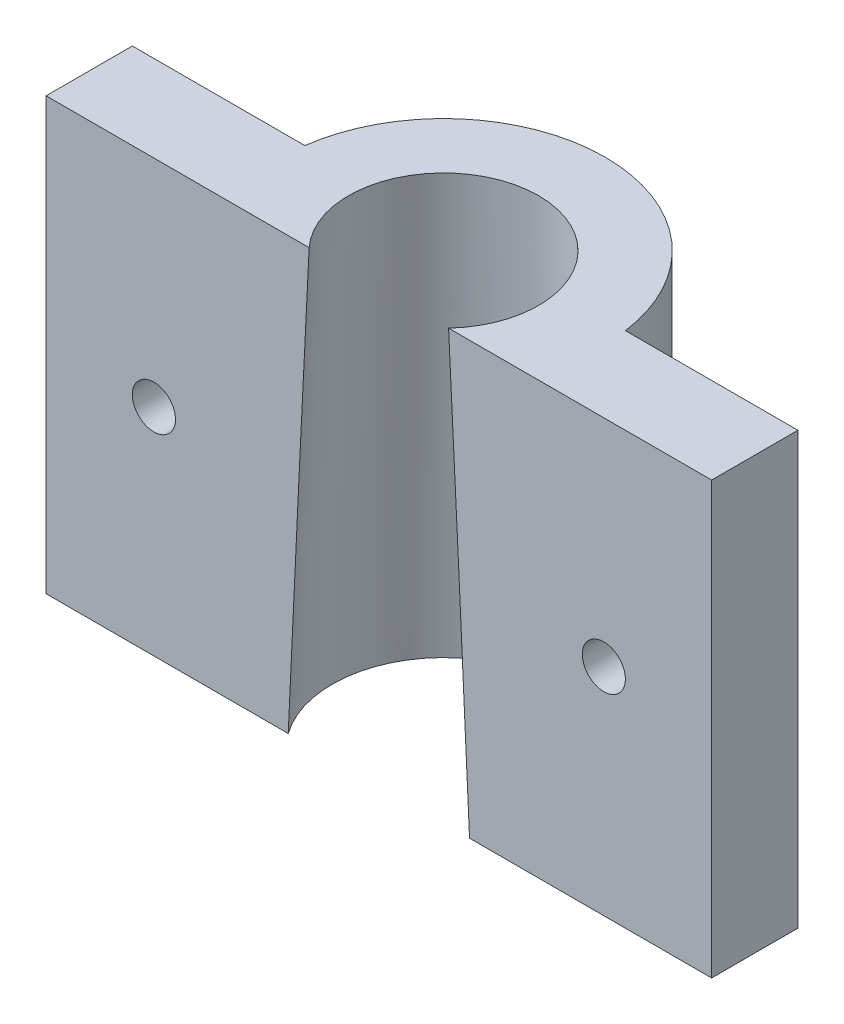
ISO-10303-21;
HEADER;
FILE_DESCRIPTION(('STEP AP214'),'2;1');
FILE_NAME('part.step','',(''),(''),'','','');
FILE_SCHEMA(('AUTOMOTIVE_DESIGN { 1 0 10303 214 1 1 1 1 }'));
ENDSEC;
DATA;
#1=APPLICATION_CONTEXT('core data for automotive mechanical design processes');
#2=APPLICATION_PROTOCOL_DEFINITION('international standard','automotive_design',2000,#1);
#3=PRODUCT_CONTEXT('',#1,'mechanical');
#4=PRODUCT('Part','Part','',(#3));
#5=PRODUCT_RELATED_PRODUCT_CATEGORY('part','',(#4));
#6=PRODUCT_DEFINITION_FORMATION('','',#4);
#7=PRODUCT_DEFINITION_CONTEXT('part definition',#1,'design');
#8=PRODUCT_DEFINITION('design','',#6,#7);
#9=PRODUCT_DEFINITION_SHAPE('','',#8);
#10=(LENGTH_UNIT() NAMED_UNIT(*) SI_UNIT(.MILLI.,.METRE.));
#11=(NAMED_UNIT(*) PLANE_ANGLE_UNIT() SI_UNIT($,.RADIAN.));
#12=(NAMED_UNIT(*) SI_UNIT($,.STERADIAN.) SOLID_ANGLE_UNIT());
#13=UNCERTAINTY_MEASURE_WITH_UNIT(LENGTH_MEASURE(1.E-05),#10,'distance_accuracy_value','');
#14=(GEOMETRIC_REPRESENTATION_CONTEXT(3) GLOBAL_UNCERTAINTY_ASSIGNED_CONTEXT((#13)) GLOBAL_UNIT_ASSIGNED_CONTEXT((#10,
#11,#12)) REPRESENTATION_CONTEXT('',''));
#15=CARTESIAN_POINT('',(0.,0.,0.));
#16=DIRECTION('',(0.,0.,1.));
#17=DIRECTION('',(1.,0.,0.));
#18=AXIS2_PLACEMENT_3D('',#15,#16,#17);
#19=CARTESIAN_POINT('',(15.4330343736593,60.,3.));
#20=DIRECTION('',(0.,0.,-1.));
#21=DIRECTION('',(-1.,0.,0.));
#22=AXIS2_PLACEMENT_3D('',#19,#20,#21);
#23=PLANE('',#22);
#24=CARTESIAN_POINT('',(-10.4330343736593,42.5,3.));
#25=DIRECTION('',(0.,0.,-1.));
#26=DIRECTION('',(1.,0.,0.));
#27=AXIS2_PLACEMENT_3D('',#24,#25,#26);
#28=CIRCLE('',#27,1.);
#29=CARTESIAN_POINT('',(-9.43303437365926,42.5,3.));
#30=VERTEX_POINT('',#29);
#31=EDGE_CURVE('E172',#30,#30,#28,.T.);
#32=ORIENTED_EDGE('',*,*,#31,.T.);
#33=EDGE_LOOP('',(#32));
#34=FACE_BOUND('',#33,.T.);
#35=DIRECTION('',(0.,-1.,0.));
#36=VECTOR('',#35,1.);
#37=CARTESIAN_POINT('',(-15.4330343736593,60.,3.));
#38=LINE('',#37,#36);
#39=CARTESIAN_POINT('',(-15.4330343736593,52.5,3.));
#40=VERTEX_POINT('',#39);
#41=CARTESIAN_POINT('',(-15.4330343736593,32.5,3.));
#42=VERTEX_POINT('',#41);
#43=EDGE_CURVE('E117',#40,#42,#38,.T.);
#44=ORIENTED_EDGE('',*,*,#43,.T.);
#45=DIRECTION('',(-1.,0.,0.));
#46=VECTOR('',#45,1.);
#47=CARTESIAN_POINT('',(-15.4330343736593,32.5,3.));
#48=LINE('',#47,#46);
#49=CARTESIAN_POINT('',(-4.20454510466969,32.5,3.));
#50=VERTEX_POINT('',#49);
#51=EDGE_CURVE('E112',#50,#42,#48,.T.);
#52=ORIENTED_EDGE('',*,*,#51,.F.);
#53=CARTESIAN_POINT('',(-6.7970653211989,-27.5114345369121,3.));
#54=CARTESIAN_POINT('',(-6.69871078157354,-25.1270260324181,3.));
#55=CARTESIAN_POINT('',(-6.60001414133945,-22.7426316265745,3.));
#56=CARTESIAN_POINT('',(-6.4018142630898,-17.9736201917859,3.));
#57=CARTESIAN_POINT('',(-6.30231093970674,-15.5890031663893,3.));
#58=CARTESIAN_POINT('',(-6.00242132289861,-8.43478617019309,3.));
#59=CARTESIAN_POINT('',(-5.80067278771601,-3.66524319009029,3.));
#60=CARTESIAN_POINT('',(-5.39226896292382,5.87364712770417,3.));
#61=CARTESIAN_POINT('',(-5.18561365934576,10.6429944648001,3.));
#62=CARTESIAN_POINT('',(-4.87040265578391,17.7961317859876,3.));
#63=CARTESIAN_POINT('',(-4.76447582691481,20.1800375802265,3.));
#64=CARTESIAN_POINT('',(-4.55047172775504,24.9477525655322,3.));
#65=CARTESIAN_POINT('',(-4.44239445767504,27.3315617566083,3.));
#66=CARTESIAN_POINT('',(-4.22357818461527,32.0990328666859,3.));
#67=CARTESIAN_POINT('',(-4.11283920983981,34.4826947869798,3.));
#68=CARTESIAN_POINT('',(-3.88798370902494,39.2498590182918,3.));
#69=CARTESIAN_POINT('',(-3.77386718407985,41.6333613293614,3.));
#70=CARTESIAN_POINT('',(-3.54125323053933,46.399486491184,3.));
#71=CARTESIAN_POINT('',(-3.42275703232255,48.7821094018508,3.));
#72=CARTESIAN_POINT('',(-3.17980660409161,53.5471242646965,3.));
#73=CARTESIAN_POINT('',(-3.05535219902303,55.9295162080264,3.));
#74=CARTESIAN_POINT('',(-2.86218400514298,59.5038278555008,3.));
#75=CARTESIAN_POINT('',(-2.79668264417257,60.6959210423072,3.));
#76=CARTESIAN_POINT('',(-2.66301438622913,63.0799576813448,3.));
#77=CARTESIAN_POINT('',(-2.59484749087833,64.2719011336665,3.));
#78=CARTESIAN_POINT('',(-2.45516754436946,66.6554887715938,3.));
#79=CARTESIAN_POINT('',(-2.38365478497229,67.8471329742172,3.));
#80=CARTESIAN_POINT('',(-2.23625823760196,70.2301470883893,3.));
#81=CARTESIAN_POINT('',(-2.16037446735979,71.421517001031,3.));
#82=CARTESIAN_POINT('',(-2.00263075228217,73.8047827566932,3.));
#83=CARTESIAN_POINT('',(-1.92076627560683,74.9966783038397,3.));
#84=CARTESIAN_POINT('',(-1.79145704162888,76.7841981543115,3.));
#85=CARTESIAN_POINT('',(-1.74726272680495,77.3800572173033,3.));
#86=CARTESIAN_POINT('',(-1.65613645322083,78.5715559773588,3.));
#87=CARTESIAN_POINT('',(-1.6092045442961,79.1671956782172,3.));
#88=CARTESIAN_POINT('',(-1.51190147222162,80.3571647521278,3.));
#89=CARTESIAN_POINT('',(-1.46153636682458,80.9514946161068,3.));
#90=CARTESIAN_POINT('',(-1.35604302177293,82.1397745347947,3.));
#91=CARTESIAN_POINT('',(-1.30091445273039,82.7337245603726,3.));
#92=CARTESIAN_POINT('',(-1.18389264719058,83.9207247777317,3.));
#93=CARTESIAN_POINT('',(-1.12200226756418,84.5137752430221,3.));
#94=CARTESIAN_POINT('',(-1.02085393920927,85.4023749802272,3.));
#95=CARTESIAN_POINT('',(-0.985754547446011,85.6983958389829,3.));
#96=CARTESIAN_POINT('',(-0.911742170671807,86.289957584769,3.));
#97=CARTESIAN_POINT('',(-0.872829339802112,86.5854984907088,3.));
#98=CARTESIAN_POINT('',(-0.810235612370623,87.0282655578576,3.));
#99=CARTESIAN_POINT('',(-0.788662933545654,87.1757888736566,3.));
#100=CARTESIAN_POINT('',(-0.743710470671355,87.4705818150249,3.));
#101=CARTESIAN_POINT('',(-0.720330439292222,87.6178514030433,3.));
#102=CARTESIAN_POINT('',(-0.671152843555685,87.9123137028763,3.));
#103=CARTESIAN_POINT('',(-0.645350271556118,88.059505593586,3.));
#104=CARTESIAN_POINT('',(-0.590400748024999,88.3532148390589,3.));
#105=CARTESIAN_POINT('',(-0.561254821863717,88.4997323863736,3.));
#106=CARTESIAN_POINT('',(-0.497849756656578,88.7921757783697,3.));
#107=CARTESIAN_POINT('',(-0.46357595437165,88.9380986515243,3.));
#108=CARTESIAN_POINT('',(-0.40514468124356,89.1548626620006,3.));
#109=CARTESIAN_POINT('',(-0.384532108625005,89.2266623532948,3.));
#110=CARTESIAN_POINT('',(-0.339732801137872,89.3691242665099,3.));
#111=CARTESIAN_POINT('',(-0.315551045511873,89.4397879233801,3.));
#112=CARTESIAN_POINT('',(-0.268879717406295,89.5578862475318,3.));
#113=CARTESIAN_POINT('',(-0.248020009091374,89.6059876504674,3.));
#114=CARTESIAN_POINT('',(-0.201108896943139,89.6991733285145,3.));
#115=CARTESIAN_POINT('',(-0.175144583334575,89.7442932288242,3.));
#116=CARTESIAN_POINT('',(-0.135804734757538,89.7937871712882,3.));
#117=CARTESIAN_POINT('',(-0.1282697158999,89.8026369984553,3.));
#118=CARTESIAN_POINT('',(-0.112345924201295,89.8195609535394,3.));
#119=CARTESIAN_POINT('',(-0.103956663452075,89.8276346329769,3.));
#120=CARTESIAN_POINT('',(-0.0875547157265007,89.8413964172109,3.));
#121=CARTESIAN_POINT('',(-0.079691742286915,89.8472599072318,3.));
#122=CARTESIAN_POINT('',(-0.0631448479454022,89.8576914200328,3.));
#123=CARTESIAN_POINT('',(-0.0544633392483832,89.8622630998578,3.));
#124=CARTESIAN_POINT('',(-0.0391231819036221,89.8684137676352,3.));
#125=CARTESIAN_POINT('',(-0.0326626863906275,89.8704806885253,3.));
#126=CARTESIAN_POINT('',(-0.0194888108034757,89.8735132482131,3.));
#127=CARTESIAN_POINT('',(-0.0127757801575999,89.8744803548098,3.));
#128=CARTESIAN_POINT('',(0.000742660612497025,89.8751998883581,3.));
#129=CARTESIAN_POINT('',(0.00754832341244973,89.8749477275807,3.));
#130=CARTESIAN_POINT('',(0.0210103080372111,89.8732511767793,3.));
#131=CARTESIAN_POINT('',(0.0276664762309222,89.8718056131871,3.));
#132=CARTESIAN_POINT('',(0.0423139235351299,89.8673860651392,3.));
#133=CARTESIAN_POINT('',(0.0502147373876179,89.8641170639926,3.));
#134=CARTESIAN_POINT('',(0.0653954918776084,89.8563697011776,3.));
#135=CARTESIAN_POINT('',(0.0726739920189855,89.8518886285671,3.));
#136=CARTESIAN_POINT('',(0.0918759642749601,89.8383912013984,3.));
#137=CARTESIAN_POINT('',(0.103174338719455,89.8284991125232,3.));
#138=CARTESIAN_POINT('',(0.124304078982786,89.8072685281139,3.));
#139=CARTESIAN_POINT('',(0.134130538534063,89.7959254190643,3.));
#140=CARTESIAN_POINT('',(0.173630188132762,89.7460851237622,3.));
#141=CARTESIAN_POINT('',(0.19834302098996,89.7037874443335,3.));
#142=CARTESIAN_POINT('',(0.242943496301836,89.6167541253344,3.));
#143=CARTESIAN_POINT('',(0.262794778291146,89.5720030060749,3.));
#144=CARTESIAN_POINT('',(0.302542894729818,89.4737834689916,3.));
#145=CARTESIAN_POINT('',(0.321908901391615,89.4200930889997,3.));
#146=CARTESIAN_POINT('',(0.358145807394525,89.3118683519213,3.));
#147=CARTESIAN_POINT('',(0.375014293598648,89.2573332341019,3.));
#148=CARTESIAN_POINT('',(0.423098170402931,89.0927564032152,3.));
#149=CARTESIAN_POINT('',(0.451715139568008,88.9819556003451,3.));
#150=CARTESIAN_POINT('',(0.504975158272817,88.7595392524195,3.));
#151=CARTESIAN_POINT('',(0.529621194879287,88.6479243864206,3.));
#152=CARTESIAN_POINT('',(0.576179746468625,88.4242840257253,3.));
#153=CARTESIAN_POINT('',(0.598095903307828,88.3122592878668,3.));
#154=CARTESIAN_POINT('',(0.660646937098292,87.9773758568315,3.));
#155=CARTESIAN_POINT('',(0.698464679690405,87.7539966063653,3.));
#156=CARTESIAN_POINT('',(0.769481826039184,87.3064945139568,3.));
#157=CARTESIAN_POINT('',(0.802680567938405,87.0823715701516,3.));
#158=CARTESIAN_POINT('',(0.897580482944988,86.408954652688,3.));
#159=CARTESIAN_POINT('',(0.954520598638084,85.9589938177018,3.));
#160=CARTESIAN_POINT('',(1.06112243796568,85.0587402992795,3.));
#161=CARTESIAN_POINT('',(1.11079199046638,84.6084485053924,3.));
#162=CARTESIAN_POINT('',(1.20520348493863,83.7075373985678,3.));
#163=CARTESIAN_POINT('',(1.24994744761203,83.2569182968534,3.));
#164=CARTESIAN_POINT('',(1.33584405345303,82.355949409047,3.));
#165=CARTESIAN_POINT('',(1.37700141439719,81.9056000673599,3.));
#166=CARTESIAN_POINT('',(1.45661001498542,81.004661386514,3.));
#167=CARTESIAN_POINT('',(1.49506124281237,80.5540720463158,3.));
#168=CARTESIAN_POINT('',(1.60723402502981,79.2020204066897,3.));
#169=CARTESIAN_POINT('',(1.6777728154281,78.3002946361387,3.));
#170=CARTESIAN_POINT('',(1.81312782244788,76.4962045349554,3.));
#171=CARTESIAN_POINT('',(1.87794267234677,75.5938401033957,3.));
#172=CARTESIAN_POINT('',(2.0033477346308,73.7888301513356,3.));
#173=CARTESIAN_POINT('',(2.06393799964486,72.8861846344775,3.));
#174=CARTESIAN_POINT('',(2.18189847182706,71.0804737495935,3.));
#175=CARTESIAN_POINT('',(2.23926792753866,70.1774083327458,3.));
#176=CARTESIAN_POINT('',(2.35143901495114,68.3711156944409,3.));
#177=CARTESIAN_POINT('',(2.40624063866966,67.4678884724896,3.));
#178=CARTESIAN_POINT('',(2.51374943078739,65.6614029923076,3.));
#179=CARTESIAN_POINT('',(2.56645681416183,64.758144746838,3.));
#180=CARTESIAN_POINT('',(2.67013418333457,62.9515298928751,3.));
#181=CARTESIAN_POINT('',(2.72110417125747,62.0481732845036,3.));
#182=CARTESIAN_POINT('',(2.87314341537804,59.3143521221553,3.));
#183=CARTESIAN_POINT('',(2.97195110247079,57.4837617749553,3.));
#184=CARTESIAN_POINT('',(3.16516995598657,53.8223484898922,3.));
#185=CARTESIAN_POINT('',(3.25958111725403,51.9915255517588,3.));
#186=CARTESIAN_POINT('',(3.44501631090039,48.3297013701109,3.));
#187=CARTESIAN_POINT('',(3.53604033014115,46.4987001259324,3.));
#188=CARTESIAN_POINT('',(3.71540256243897,42.8365659082053,3.));
#189=CARTESIAN_POINT('',(3.80374077468739,41.0054329346174,3.));
#190=CARTESIAN_POINT('',(4.06552953572165,35.5116960689229,3.));
#191=CARTESIAN_POINT('',(4.23574501320876,31.8489380954136,3.));
#192=CARTESIAN_POINT('',(4.57024334584803,24.5231610722876,3.));
#193=CARTESIAN_POINT('',(4.734526214038,20.8601420232624,3.));
#194=CARTESIAN_POINT('',(5.05872486559669,13.534425676965,3.));
#195=CARTESIAN_POINT('',(5.21864125815182,9.8717284066082,3.));
#196=CARTESIAN_POINT('',(5.5351903708059,2.54619027202829,3.));
#197=CARTESIAN_POINT('',(5.69182308910936,-1.11665059227219,3.));
#198=CARTESIAN_POINT('',(6.00252735996518,-8.44239008985646,3.));
#199=CARTESIAN_POINT('',(6.15659894789064,-12.1052887216418,3.));
#200=CARTESIAN_POINT('',(6.46270356093832,-19.4311711399519,3.));
#201=CARTESIAN_POINT('',(6.6147365860406,-23.0941549264775,3.));
#202=CARTESIAN_POINT('',(6.77632024714624,-27.0085932252858,3.));
#203=CARTESIAN_POINT('',(6.78669470293798,-27.2600138021523,3.));
#204=CARTESIAN_POINT('',(6.7970653211989,-27.5114345369121,3.));
#205=B_SPLINE_CURVE_WITH_KNOTS('',3,(#53,#54,#55,#56,#57,#58,#59,#60,#61,#62,#63,#64,#65,#66,
#67,#68,#69,#70,#71,#72,#73,#74,#75,#76,#77,#78,#79,#80,#81,#82,#83,#84,#85,#86,#87,#88,#89,#90,
#91,#92,#93,#94,#95,#96,#97,#98,#99,#100,#101,#102,#103,#104,#105,#106,#107,#108,#109,#110,#111,
#112,#113,#114,#115,#116,#117,#118,#119,#120,#121,#122,#123,#124,#125,#126,#127,#128,#129,#130,
#131,#132,#133,#134,#135,#136,#137,#138,#139,#140,#141,#142,#143,#144,#145,#146,#147,#148,#149,
#150,#151,#152,#153,#154,#155,#156,#157,#158,#159,#160,#161,#162,#163,#164,#165,#166,#167,#168,
#169,#170,#171,#172,#173,#174,#175,#176,#177,#178,#179,#180,#181,#182,#183,#184,#185,#186,#187,
#188,#189,#190,#191,#192,#193,#194,#195,#196,#197,#198,#199,#200,#201,#202,#203,#204),
.UNSPECIFIED.,.F.,.F.,(4,2,2,2,2,2,2,2,2,2,2,2,2,2,2,2,2,2,2,2,2,2,2,2,2,2,2,2,2,2,2,2,2,2,2,2,
2,2,2,2,2,2,2,2,2,2,2,2,2,2,2,2,2,2,2,2,2,2,2,2,2,2,2,2,2,2,2,2,2,2,2,2,2,2,2,4),(0.,
7.15930845170513,14.3193846951006,28.6408069876903,42.9622700550499,50.1210433711738,
57.2798159859545,64.4385127773964,71.5972072494309,78.753905696244,85.9108145388203,
89.492486365735,93.0741560128917,96.6555139167827,100.236857293936,103.820943133912,
105.613425576715,107.405875399149,109.195240519309,110.984729471147,112.773465264935,
113.66773395529,114.561966513723,115.009234744421,115.456564290916,115.904839774266,
116.35297814214,116.802423366688,117.026503307415,117.250273546096,117.407594724823,
117.56243415452,117.597261808706,117.632109467816,117.661454527508,117.690715661035,
117.710985249255,117.731227754065,117.751546484351,117.771885219498,117.797391524536,
117.822955356051,117.867751686675,117.912694162218,118.058515209944,118.205395678752,
118.376463800519,118.547696146754,118.890837081289,119.23371867643,119.576137828879,
120.255720383014,120.93540021459,122.295919431931,123.654962706093,125.013446344383,
126.370115190567,127.726789960679,130.440200199521,133.154256585643,135.868279154617,
138.582932330941,141.297593945477,144.011976174361,146.726355083817,152.226111865184,
157.725875095635,163.225659656484,168.725445873184,179.725570584981,190.725671120855,
201.724229060084,212.722793013096,223.721204932816,234.719616960088,235.474520544641),.UNSPECIFIED.);
#206=CARTESIAN_POINT('',(-3.23286690791412,52.5,3.));
#207=VERTEX_POINT('',#206);
#208=EDGE_CURVE('E123',#50,#207,#205,.T.);
#209=ORIENTED_EDGE('',*,*,#208,.T.);
#210=DIRECTION('',(1.,0.,0.));
#211=VECTOR('',#210,1.);
#212=CARTESIAN_POINT('',(-15.4330343736593,52.5,3.));
#213=LINE('',#212,#211);
#214=EDGE_CURVE('E47',#40,#207,#213,.T.);
#215=ORIENTED_EDGE('',*,*,#214,.F.);
#216=EDGE_LOOP('',(#44,#52,#209,#215));
#217=FACE_BOUND('',#216,.T.);
#218=ADVANCED_FACE('F32',(#34,#217),#23,.F.);
#219=CARTESIAN_POINT('',(10.4330343736593,42.5,3.));
#220=DIRECTION('',(0.,0.,-1.));
#221=DIRECTION('',(-1.,0.,0.));
#222=AXIS2_PLACEMENT_3D('',#219,#220,#221);
#223=CIRCLE('',#222,1.);
#224=CARTESIAN_POINT('',(9.43303437365926,42.5,3.));
#225=VERTEX_POINT('',#224);
#226=EDGE_CURVE('E178',#225,#225,#223,.T.);
#227=ORIENTED_EDGE('',*,*,#226,.T.);
#228=EDGE_LOOP('',(#227));
#229=FACE_BOUND('',#228,.T.);
#230=CARTESIAN_POINT('',(3.23286690791413,52.5,3.));
#231=VERTEX_POINT('',#230);
#232=CARTESIAN_POINT('',(4.20454510466969,32.5,3.));
#233=VERTEX_POINT('',#232);
#234=EDGE_CURVE('E111',#231,#233,#205,.T.);
#235=ORIENTED_EDGE('',*,*,#234,.T.);
#236=CARTESIAN_POINT('',(15.4330343736593,32.5,3.));
#237=VERTEX_POINT('',#236);
#238=EDGE_CURVE('E55',#237,#233,#48,.T.);
#239=ORIENTED_EDGE('',*,*,#238,.F.);
#240=DIRECTION('',(0.,-1.,0.));
#241=VECTOR('',#240,1.);
#242=CARTESIAN_POINT('',(15.4330343736593,60.,3.));
#243=LINE('',#242,#241);
#244=CARTESIAN_POINT('',(15.4330343736593,52.5,3.));
#245=VERTEX_POINT('',#244);
#246=EDGE_CURVE('E109',#245,#237,#243,.T.);
#247=ORIENTED_EDGE('',*,*,#246,.F.);
#248=EDGE_CURVE('E189',#231,#245,#213,.T.);
#249=ORIENTED_EDGE('',*,*,#248,.F.);
#250=EDGE_LOOP('',(#235,#239,#247,#249));
#251=FACE_BOUND('',#250,.T.);
#252=ADVANCED_FACE('F107',(#229,#251),#23,.F.);
#253=CARTESIAN_POINT('',(15.4330343736593,60.,-0.999999999999998));
#254=DIRECTION('',(0.,0.,1.));
#255=DIRECTION('',(1.,0.,0.));
#256=AXIS2_PLACEMENT_3D('',#253,#254,#255);
#257=PLANE('',#256);
#258=CARTESIAN_POINT('',(10.4330343736593,42.5,-1.));
#259=DIRECTION('',(0.,0.,-1.));
#260=DIRECTION('',(-1.,0.,0.));
#261=AXIS2_PLACEMENT_3D('',#258,#259,#260);
#262=CIRCLE('',#261,1.);
#263=CARTESIAN_POINT('',(9.43303437365926,42.5,-1.));
#264=VERTEX_POINT('',#263);
#265=EDGE_CURVE('E174',#264,#264,#262,.T.);
#266=ORIENTED_EDGE('',*,*,#265,.F.);
#267=EDGE_LOOP('',(#266));
#268=FACE_BOUND('',#267,.T.);
#269=DIRECTION('',(0.,-1.,0.));
#270=VECTOR('',#269,1.);
#271=CARTESIAN_POINT('',(15.4330343736593,60.,-0.999999999999998));
#272=LINE('',#271,#270);
#273=CARTESIAN_POINT('',(15.4330343736593,52.5,-0.999999999999997));
#274=VERTEX_POINT('',#273);
#275=CARTESIAN_POINT('',(15.4330343736593,32.5,-0.999999999999997));
#276=VERTEX_POINT('',#275);
#277=EDGE_CURVE('E118',#274,#276,#272,.T.);
#278=ORIENTED_EDGE('',*,*,#277,.T.);
#279=DIRECTION('',(-1.,0.,0.));
#280=VECTOR('',#279,1.);
#281=CARTESIAN_POINT('',(15.4330343736593,32.5,-0.999999999999998));
#282=LINE('',#281,#280);
#283=CARTESIAN_POINT('',(7.43303437365925,32.5,-0.999999999999971));
#284=VERTEX_POINT('',#283);
#285=EDGE_CURVE('E97',#276,#284,#282,.T.);
#286=ORIENTED_EDGE('',*,*,#285,.T.);
#287=DIRECTION('',(0.,-1.,0.));
#288=VECTOR('',#287,1.);
#289=CARTESIAN_POINT('',(7.43303437365925,60.,-0.999999999999971));
#290=LINE('',#289,#288);
#291=CARTESIAN_POINT('',(7.43303437365925,52.5,-0.999999999999971));
#292=VERTEX_POINT('',#291);
#293=EDGE_CURVE('E132',#292,#284,#290,.T.);
#294=ORIENTED_EDGE('',*,*,#293,.F.);
#295=DIRECTION('',(1.,0.,0.));
#296=VECTOR('',#295,1.);
#297=CARTESIAN_POINT('',(15.4330343736593,52.5,-0.999999999999998));
#298=LINE('',#297,#296);
#299=EDGE_CURVE('E197',#292,#274,#298,.T.);
#300=ORIENTED_EDGE('',*,*,#299,.T.);
#301=EDGE_LOOP('',(#278,#286,#294,#300));
#302=FACE_BOUND('',#301,.T.);
#303=ADVANCED_FACE('F34',(#268,#302),#257,.F.);
#304=CARTESIAN_POINT('',(0.,60.,0.));
#305=DIRECTION('',(0.,-1.,0.));
#306=DIRECTION('',(0.,0.,-1.));
#307=AXIS2_PLACEMENT_3D('',#304,#305,#306);
#308=CYLINDRICAL_SURFACE('',#307,7.5);
#309=ORIENTED_EDGE('',*,*,#293,.T.);
#310=CARTESIAN_POINT('',(0.,32.5,0.));
#311=DIRECTION('',(0.,1.,0.));
#312=DIRECTION('',(0.,0.,1.));
#313=AXIS2_PLACEMENT_3D('',#310,#311,#312);
#314=CIRCLE('',#313,7.5);
#315=CARTESIAN_POINT('',(-7.43303437365925,32.5,-0.999999999999999));
#316=VERTEX_POINT('',#315);
#317=EDGE_CURVE('E202',#284,#316,#314,.T.);
#318=ORIENTED_EDGE('',*,*,#317,.T.);
#319=DIRECTION('',(0.,-1.,0.));
#320=VECTOR('',#319,1.);
#321=CARTESIAN_POINT('',(-7.43303437365925,60.,-0.999999999999999));
#322=LINE('',#321,#320);
#323=CARTESIAN_POINT('',(-7.43303437365925,52.5,-0.999999999999999));
#324=VERTEX_POINT('',#323);
#325=EDGE_CURVE('E129',#324,#316,#322,.T.);
#326=ORIENTED_EDGE('',*,*,#325,.F.);
#327=CARTESIAN_POINT('',(0.,52.5,0.));
#328=DIRECTION('',(0.,-1.,0.));
#329=DIRECTION('',(0.,0.,-1.));
#330=AXIS2_PLACEMENT_3D('',#327,#328,#329);
#331=CIRCLE('',#330,7.5);
#332=EDGE_CURVE('E194',#324,#292,#331,.T.);
#333=ORIENTED_EDGE('',*,*,#332,.T.);
#334=EDGE_LOOP('',(#309,#318,#326,#333));
#335=FACE_BOUND('',#334,.T.);
#336=ADVANCED_FACE('F208',(#335),#308,.T.);
#337=CARTESIAN_POINT('',(-15.4330343736593,60.,-0.999999999999998));
#338=DIRECTION('',(0.,0.,1.));
#339=DIRECTION('',(1.,0.,0.));
#340=AXIS2_PLACEMENT_3D('',#337,#338,#339);
#341=PLANE('',#340);
#342=CARTESIAN_POINT('',(-10.4330343736593,42.5,-0.999999999999999));
#343=DIRECTION('',(0.,0.,-1.));
#344=DIRECTION('',(1.,0.,0.));
#345=AXIS2_PLACEMENT_3D('',#342,#343,#344);
#346=CIRCLE('',#345,1.);
#347=CARTESIAN_POINT('',(-9.43303437365926,42.5,-0.999999999999999));
#348=VERTEX_POINT('',#347);
#349=EDGE_CURVE('E175',#348,#348,#346,.T.);
#350=ORIENTED_EDGE('',*,*,#349,.F.);
#351=EDGE_LOOP('',(#350));
#352=FACE_BOUND('',#351,.T.);
#353=ORIENTED_EDGE('',*,*,#325,.T.);
#354=DIRECTION('',(-1.,0.,0.));
#355=VECTOR('',#354,1.);
#356=CARTESIAN_POINT('',(-15.4330343736593,32.5,-0.999999999999998));
#357=LINE('',#356,#355);
#358=CARTESIAN_POINT('',(-15.4330343736593,32.5,-0.999999999999997));
#359=VERTEX_POINT('',#358);
#360=EDGE_CURVE('E200',#316,#359,#357,.T.);
#361=ORIENTED_EDGE('',*,*,#360,.T.);
#362=DIRECTION('',(0.,-1.,0.));
#363=VECTOR('',#362,1.);
#364=CARTESIAN_POINT('',(-15.4330343736593,60.,-0.999999999999998));
#365=LINE('',#364,#363);
#366=CARTESIAN_POINT('',(-15.4330343736593,52.5,-0.999999999999997));
#367=VERTEX_POINT('',#366);
#368=EDGE_CURVE('E121',#367,#359,#365,.T.);
#369=ORIENTED_EDGE('',*,*,#368,.F.);
#370=DIRECTION('',(1.,0.,0.));
#371=VECTOR('',#370,1.);
#372=CARTESIAN_POINT('',(-15.4330343736593,52.5,-0.999999999999998));
#373=LINE('',#372,#371);
#374=EDGE_CURVE('E185',#367,#324,#373,.T.);
#375=ORIENTED_EDGE('',*,*,#374,.T.);
#376=EDGE_LOOP('',(#353,#361,#369,#375));
#377=FACE_BOUND('',#376,.T.);
#378=ADVANCED_FACE('F162',(#352,#377),#341,.F.);
#379=CARTESIAN_POINT('',(-15.4330343736593,60.,3.));
#380=DIRECTION('',(1.,0.,0.));
#381=DIRECTION('',(0.,0.,-1.));
#382=AXIS2_PLACEMENT_3D('',#379,#380,#381);
#383=PLANE('',#382);
#384=ORIENTED_EDGE('',*,*,#368,.T.);
#385=DIRECTION('',(0.,0.,1.));
#386=VECTOR('',#385,1.);
#387=CARTESIAN_POINT('',(-15.4330343736593,32.5,-12.));
#388=LINE('',#387,#386);
#389=EDGE_CURVE('E102',#359,#42,#388,.T.);
#390=ORIENTED_EDGE('',*,*,#389,.T.);
#391=ORIENTED_EDGE('',*,*,#43,.F.);
#392=DIRECTION('',(0.,0.,1.));
#393=VECTOR('',#392,1.);
#394=CARTESIAN_POINT('',(-15.4330343736593,52.5,-12.));
#395=LINE('',#394,#393);
#396=EDGE_CURVE('E188',#367,#40,#395,.T.);
#397=ORIENTED_EDGE('',*,*,#396,.F.);
#398=EDGE_LOOP('',(#384,#390,#391,#397));
#399=FACE_BOUND('',#398,.T.);
#400=ADVANCED_FACE('F158',(#399),#383,.F.);
#401=CARTESIAN_POINT('',(15.4330343736593,60.,3.));
#402=DIRECTION('',(-1.,0.,0.));
#403=DIRECTION('',(0.,0.,1.));
#404=AXIS2_PLACEMENT_3D('',#401,#402,#403);
#405=PLANE('',#404);
#406=ORIENTED_EDGE('',*,*,#246,.T.);
#407=DIRECTION('',(0.,0.,1.));
#408=VECTOR('',#407,1.);
#409=CARTESIAN_POINT('',(15.4330343736593,32.5,-12.));
#410=LINE('',#409,#408);
#411=EDGE_CURVE('E94',#276,#237,#410,.T.);
#412=ORIENTED_EDGE('',*,*,#411,.F.);
#413=ORIENTED_EDGE('',*,*,#277,.F.);
#414=DIRECTION('',(0.,0.,1.));
#415=VECTOR('',#414,1.);
#416=CARTESIAN_POINT('',(15.4330343736593,52.5,-12.));
#417=LINE('',#416,#415);
#418=EDGE_CURVE('E116',#274,#245,#417,.T.);
#419=ORIENTED_EDGE('',*,*,#418,.T.);
#420=EDGE_LOOP('',(#406,#412,#413,#419));
#421=FACE_BOUND('',#420,.T.);
#422=ADVANCED_FACE('F115',(#421),#405,.F.);
#423=CARTESIAN_POINT('',(0.,70.,0.));
#424=DIRECTION('',(0.,-1.,0.));
#425=DIRECTION('',(0.,0.,-1.));
#426=AXIS2_PLACEMENT_3D('',#423,#424,#425);
#427=CONICAL_SURFACE('',#426,3.75,0.0377179524668642);
#428=ORIENTED_EDGE('',*,*,#208,.F.);
#429=CARTESIAN_POINT('',(0.,32.5,0.));
#430=DIRECTION('',(0.,1.,0.));
#431=DIRECTION('',(0.,0.,1.));
#432=AXIS2_PLACEMENT_3D('',#429,#430,#431);
#433=CIRCLE('',#432,5.16509433962264);
#434=EDGE_CURVE('E11',#50,#233,#433,.F.);
#435=ORIENTED_EDGE('',*,*,#434,.T.);
#436=ORIENTED_EDGE('',*,*,#234,.F.);
#437=CARTESIAN_POINT('',(0.,52.5,0.));
#438=DIRECTION('',(0.,-1.,0.));
#439=DIRECTION('',(0.,0.,-1.));
#440=AXIS2_PLACEMENT_3D('',#437,#438,#439);
#441=CIRCLE('',#440,4.41037735849057);
#442=EDGE_CURVE('E40',#231,#207,#441,.F.);
#443=ORIENTED_EDGE('',*,*,#442,.T.);
#444=EDGE_LOOP('',(#428,#435,#436,#443));
#445=FACE_BOUND('',#444,.T.);
#446=ADVANCED_FACE('F137',(#445),#427,.F.);
#447=CARTESIAN_POINT('',(-15.4330343736593,52.5,-12.));
#448=DIRECTION('',(0.,-1.,0.));
#449=DIRECTION('',(0.,0.,-1.));
#450=AXIS2_PLACEMENT_3D('',#447,#448,#449);
#451=PLANE('',#450);
#452=ORIENTED_EDGE('',*,*,#332,.F.);
#453=ORIENTED_EDGE('',*,*,#374,.F.);
#454=ORIENTED_EDGE('',*,*,#396,.T.);
#455=ORIENTED_EDGE('',*,*,#214,.T.);
#456=ORIENTED_EDGE('',*,*,#442,.F.);
#457=ORIENTED_EDGE('',*,*,#248,.T.);
#458=ORIENTED_EDGE('',*,*,#418,.F.);
#459=ORIENTED_EDGE('',*,*,#299,.F.);
#460=EDGE_LOOP('',(#452,#453,#454,#455,#456,#457,#458,#459));
#461=FACE_BOUND('',#460,.T.);
#462=ADVANCED_FACE('F155',(#461),#451,.F.);
#463=CARTESIAN_POINT('',(-15.4330343736593,32.5,-12.));
#464=DIRECTION('',(0.,1.,0.));
#465=DIRECTION('',(0.,0.,1.));
#466=AXIS2_PLACEMENT_3D('',#463,#464,#465);
#467=PLANE('',#466);
#468=ORIENTED_EDGE('',*,*,#411,.T.);
#469=ORIENTED_EDGE('',*,*,#238,.T.);
#470=ORIENTED_EDGE('',*,*,#434,.F.);
#471=ORIENTED_EDGE('',*,*,#51,.T.);
#472=ORIENTED_EDGE('',*,*,#389,.F.);
#473=ORIENTED_EDGE('',*,*,#360,.F.);
#474=ORIENTED_EDGE('',*,*,#317,.F.);
#475=ORIENTED_EDGE('',*,*,#285,.F.);
#476=EDGE_LOOP('',(#468,#469,#470,#471,#472,#473,#474,#475));
#477=FACE_BOUND('',#476,.T.);
#478=ADVANCED_FACE('F95',(#477),#467,.F.);
#479=CARTESIAN_POINT('',(-10.4330343736593,42.5,3.));
#480=DIRECTION('',(0.,0.,-1.));
#481=DIRECTION('',(-1.,0.,0.));
#482=AXIS2_PLACEMENT_3D('',#479,#480,#481);
#483=CYLINDRICAL_SURFACE('',#482,1.);
#484=ORIENTED_EDGE('',*,*,#31,.F.);
#485=EDGE_LOOP('',(#484));
#486=FACE_BOUND('',#485,.T.);
#487=ORIENTED_EDGE('',*,*,#349,.T.);
#488=EDGE_LOOP('',(#487));
#489=FACE_BOUND('',#488,.T.);
#490=ADVANCED_FACE('F220',(#486,#489),#483,.F.);
#491=CARTESIAN_POINT('',(10.4330343736593,42.5,3.));
#492=DIRECTION('',(0.,0.,-1.));
#493=DIRECTION('',(-1.,0.,0.));
#494=AXIS2_PLACEMENT_3D('',#491,#492,#493);
#495=CYLINDRICAL_SURFACE('',#494,1.);
#496=ORIENTED_EDGE('',*,*,#226,.F.);
#497=EDGE_LOOP('',(#496));
#498=FACE_BOUND('',#497,.T.);
#499=ORIENTED_EDGE('',*,*,#265,.T.);
#500=EDGE_LOOP('',(#499));
#501=FACE_BOUND('',#500,.T.);
#502=ADVANCED_FACE('F222',(#498,#501),#495,.F.);
#503=CLOSED_SHELL('',(#218,#252,#303,#336,#378,#400,#422,#446,#462,#478,#490,#502));
#504=MANIFOLD_SOLID_BREP('B2',#503);
#505=ADVANCED_BREP_SHAPE_REPRESENTATION('',(#18,#504),#14);
#506=SHAPE_DEFINITION_REPRESENTATION(#9,#505);
ENDSEC;
END-ISO-10303-21;
